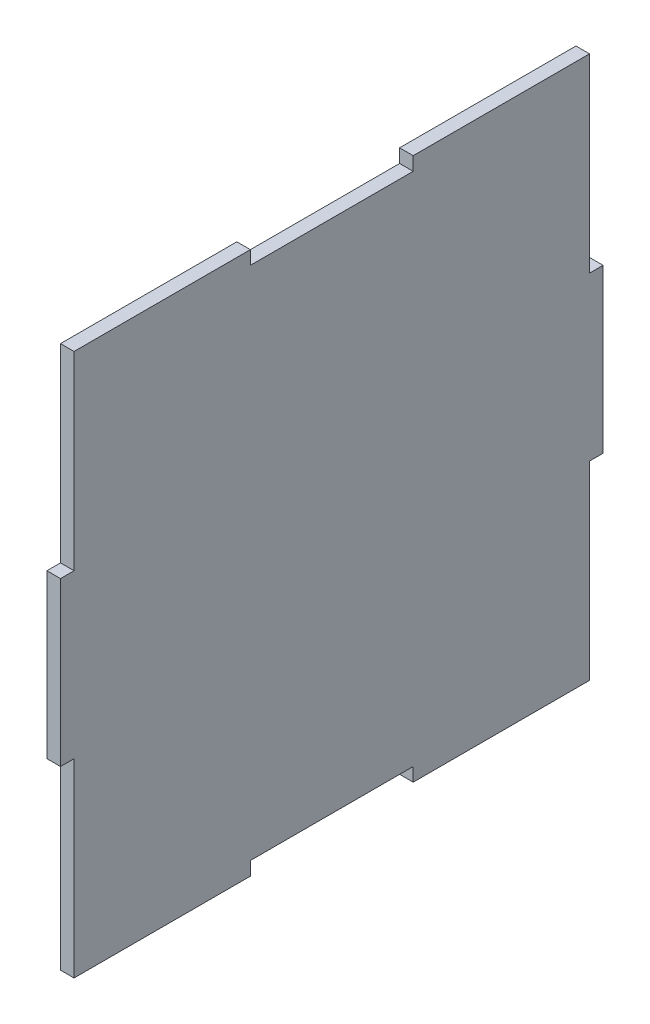
ISO-10303-21;
HEADER;
FILE_DESCRIPTION(('STEP AP214'),'2;1');
FILE_NAME('part.step','',(''),(''),'','','');
FILE_SCHEMA(('AUTOMOTIVE_DESIGN { 1 0 10303 214 1 1 1 1 }'));
ENDSEC;
DATA;
#1=APPLICATION_CONTEXT('core data for automotive mechanical design processes');
#2=APPLICATION_PROTOCOL_DEFINITION('international standard','automotive_design',2000,#1);
#3=PRODUCT_CONTEXT('',#1,'mechanical');
#4=PRODUCT('Part','Part','',(#3));
#5=PRODUCT_RELATED_PRODUCT_CATEGORY('part','',(#4));
#6=PRODUCT_DEFINITION_FORMATION('','',#4);
#7=PRODUCT_DEFINITION_CONTEXT('part definition',#1,'design');
#8=PRODUCT_DEFINITION('design','',#6,#7);
#9=PRODUCT_DEFINITION_SHAPE('','',#8);
#10=(LENGTH_UNIT() NAMED_UNIT(*) SI_UNIT(.MILLI.,.METRE.));
#11=(NAMED_UNIT(*) PLANE_ANGLE_UNIT() SI_UNIT($,.RADIAN.));
#12=(NAMED_UNIT(*) SI_UNIT($,.STERADIAN.) SOLID_ANGLE_UNIT());
#13=UNCERTAINTY_MEASURE_WITH_UNIT(LENGTH_MEASURE(1.E-05),#10,'distance_accuracy_value','');
#14=(GEOMETRIC_REPRESENTATION_CONTEXT(3) GLOBAL_UNCERTAINTY_ASSIGNED_CONTEXT((#13)) GLOBAL_UNIT_ASSIGNED_CONTEXT((#10,
#11,#12)) REPRESENTATION_CONTEXT('',''));
#15=CARTESIAN_POINT('',(0.,0.,0.));
#16=DIRECTION('',(0.,0.,1.));
#17=DIRECTION('',(1.,0.,0.));
#18=AXIS2_PLACEMENT_3D('',#15,#16,#17);
#19=CARTESIAN_POINT('',(3.175,-19.05,63.5));
#20=DIRECTION('',(0.,1.,0.));
#21=DIRECTION('',(0.,0.,1.));
#22=AXIS2_PLACEMENT_3D('',#19,#20,#21);
#23=PLANE('',#22);
#24=DIRECTION('',(0.,0.,-1.));
#25=VECTOR('',#24,1.);
#26=CARTESIAN_POINT('',(0.,-19.05,63.5));
#27=LINE('',#26,#25);
#28=CARTESIAN_POINT('',(0.,-19.05,63.5));
#29=VERTEX_POINT('',#28);
#30=CARTESIAN_POINT('',(0.,-19.05,60.325));
#31=VERTEX_POINT('',#30);
#32=EDGE_CURVE('E211',#29,#31,#27,.T.);
#33=ORIENTED_EDGE('',*,*,#32,.T.);
#34=DIRECTION('',(-1.,0.,0.));
#35=VECTOR('',#34,1.);
#36=CARTESIAN_POINT('',(3.175,-19.05,60.325));
#37=LINE('',#36,#35);
#38=CARTESIAN_POINT('',(3.175,-19.05,60.325));
#39=VERTEX_POINT('',#38);
#40=EDGE_CURVE('E11',#39,#31,#37,.T.);
#41=ORIENTED_EDGE('',*,*,#40,.F.);
#42=DIRECTION('',(0.,0.,-1.));
#43=VECTOR('',#42,1.);
#44=CARTESIAN_POINT('',(3.175,-19.05,63.5));
#45=LINE('',#44,#43);
#46=CARTESIAN_POINT('',(3.175,-19.05,63.5));
#47=VERTEX_POINT('',#46);
#48=EDGE_CURVE('E129',#47,#39,#45,.T.);
#49=ORIENTED_EDGE('',*,*,#48,.F.);
#50=DIRECTION('',(-1.,0.,0.));
#51=VECTOR('',#50,1.);
#52=CARTESIAN_POINT('',(3.175,-19.05,63.5));
#53=LINE('',#52,#51);
#54=EDGE_CURVE('E56',#47,#29,#53,.T.);
#55=ORIENTED_EDGE('',*,*,#54,.T.);
#56=EDGE_LOOP('',(#33,#41,#49,#55));
#57=FACE_BOUND('',#56,.T.);
#58=ADVANCED_FACE('F39',(#57),#23,.F.);
#59=CARTESIAN_POINT('',(3.175,-63.5,60.325));
#60=DIRECTION('',(0.,0.,1.));
#61=DIRECTION('',(1.,0.,0.));
#62=AXIS2_PLACEMENT_3D('',#59,#60,#61);
#63=PLANE('',#62);
#64=DIRECTION('',(0.,1.,0.));
#65=VECTOR('',#64,1.);
#66=CARTESIAN_POINT('',(0.,-63.5,60.325));
#67=LINE('',#66,#65);
#68=CARTESIAN_POINT('',(0.,-63.5,60.325));
#69=VERTEX_POINT('',#68);
#70=EDGE_CURVE('E214',#69,#31,#67,.T.);
#71=ORIENTED_EDGE('',*,*,#70,.F.);
#72=DIRECTION('',(-1.,0.,0.));
#73=VECTOR('',#72,1.);
#74=CARTESIAN_POINT('',(3.175,-63.5,60.325));
#75=LINE('',#74,#73);
#76=CARTESIAN_POINT('',(3.175,-63.5,60.325));
#77=VERTEX_POINT('',#76);
#78=EDGE_CURVE('E48',#77,#69,#75,.T.);
#79=ORIENTED_EDGE('',*,*,#78,.F.);
#80=DIRECTION('',(0.,1.,0.));
#81=VECTOR('',#80,1.);
#82=CARTESIAN_POINT('',(3.175,-63.5,60.325));
#83=LINE('',#82,#81);
#84=EDGE_CURVE('E349',#77,#39,#83,.T.);
#85=ORIENTED_EDGE('',*,*,#84,.T.);
#86=ORIENTED_EDGE('',*,*,#40,.T.);
#87=EDGE_LOOP('',(#71,#79,#85,#86));
#88=FACE_BOUND('',#87,.T.);
#89=ADVANCED_FACE('F348',(#88),#63,.T.);
#90=CARTESIAN_POINT('',(3.175,-63.5,60.325));
#91=DIRECTION('',(0.,1.,0.));
#92=DIRECTION('',(0.,0.,1.));
#93=AXIS2_PLACEMENT_3D('',#90,#91,#92);
#94=PLANE('',#93);
#95=DIRECTION('',(0.,0.,-1.));
#96=VECTOR('',#95,1.);
#97=CARTESIAN_POINT('',(0.,-63.5,60.325));
#98=LINE('',#97,#96);
#99=CARTESIAN_POINT('',(0.,-63.4999999999999,19.05));
#100=VERTEX_POINT('',#99);
#101=EDGE_CURVE('E218',#69,#100,#98,.T.);
#102=ORIENTED_EDGE('',*,*,#101,.T.);
#103=DIRECTION('',(-1.,0.,0.));
#104=VECTOR('',#103,1.);
#105=CARTESIAN_POINT('',(3.175,-63.4999999999999,19.05));
#106=LINE('',#105,#104);
#107=CARTESIAN_POINT('',(3.175,-63.4999999999999,19.05));
#108=VERTEX_POINT('',#107);
#109=EDGE_CURVE('E331',#108,#100,#106,.T.);
#110=ORIENTED_EDGE('',*,*,#109,.F.);
#111=DIRECTION('',(0.,0.,-1.));
#112=VECTOR('',#111,1.);
#113=CARTESIAN_POINT('',(3.175,-63.5,60.325));
#114=LINE('',#113,#112);
#115=EDGE_CURVE('E340',#77,#108,#114,.T.);
#116=ORIENTED_EDGE('',*,*,#115,.F.);
#117=ORIENTED_EDGE('',*,*,#78,.T.);
#118=EDGE_LOOP('',(#102,#110,#116,#117));
#119=FACE_BOUND('',#118,.T.);
#120=ADVANCED_FACE('F338',(#119),#94,.F.);
#121=CARTESIAN_POINT('',(3.175,-63.4999999999999,19.05));
#122=DIRECTION('',(0.,0.,1.));
#123=DIRECTION('',(1.,0.,0.));
#124=AXIS2_PLACEMENT_3D('',#121,#122,#123);
#125=PLANE('',#124);
#126=DIRECTION('',(0.,1.,0.));
#127=VECTOR('',#126,1.);
#128=CARTESIAN_POINT('',(0.,-63.4999999999999,19.05));
#129=LINE('',#128,#127);
#130=CARTESIAN_POINT('',(0.,-60.3249999999999,19.05));
#131=VERTEX_POINT('',#130);
#132=EDGE_CURVE('E221',#100,#131,#129,.T.);
#133=ORIENTED_EDGE('',*,*,#132,.T.);
#134=DIRECTION('',(-1.,0.,0.));
#135=VECTOR('',#134,1.);
#136=CARTESIAN_POINT('',(3.175,-60.3249999999999,19.05));
#137=LINE('',#136,#135);
#138=CARTESIAN_POINT('',(3.175,-60.3249999999999,19.05));
#139=VERTEX_POINT('',#138);
#140=EDGE_CURVE('E327',#139,#131,#137,.T.);
#141=ORIENTED_EDGE('',*,*,#140,.F.);
#142=DIRECTION('',(0.,1.,0.));
#143=VECTOR('',#142,1.);
#144=CARTESIAN_POINT('',(3.175,-63.4999999999999,19.05));
#145=LINE('',#144,#143);
#146=EDGE_CURVE('E600',#108,#139,#145,.T.);
#147=ORIENTED_EDGE('',*,*,#146,.F.);
#148=ORIENTED_EDGE('',*,*,#109,.T.);
#149=EDGE_LOOP('',(#133,#141,#147,#148));
#150=FACE_BOUND('',#149,.T.);
#151=ADVANCED_FACE('F367',(#150),#125,.F.);
#152=CARTESIAN_POINT('',(3.175,-60.3249999999999,19.05));
#153=DIRECTION('',(0.,1.,0.));
#154=DIRECTION('',(0.,0.,1.));
#155=AXIS2_PLACEMENT_3D('',#152,#153,#154);
#156=PLANE('',#155);
#157=DIRECTION('',(0.,0.,-1.));
#158=VECTOR('',#157,1.);
#159=CARTESIAN_POINT('',(0.,-60.3249999999999,19.05));
#160=LINE('',#159,#158);
#161=CARTESIAN_POINT('',(0.,-60.3249999999999,-19.05));
#162=VERTEX_POINT('',#161);
#163=EDGE_CURVE('E224',#131,#162,#160,.T.);
#164=ORIENTED_EDGE('',*,*,#163,.T.);
#165=DIRECTION('',(-1.,0.,0.));
#166=VECTOR('',#165,1.);
#167=CARTESIAN_POINT('',(3.175,-60.3249999999999,-19.05));
#168=LINE('',#167,#166);
#169=CARTESIAN_POINT('',(3.175,-60.3249999999999,-19.05));
#170=VERTEX_POINT('',#169);
#171=EDGE_CURVE('E324',#170,#162,#168,.T.);
#172=ORIENTED_EDGE('',*,*,#171,.F.);
#173=DIRECTION('',(0.,0.,-1.));
#174=VECTOR('',#173,1.);
#175=CARTESIAN_POINT('',(3.175,-60.3249999999999,19.05));
#176=LINE('',#175,#174);
#177=EDGE_CURVE('E598',#139,#170,#176,.T.);
#178=ORIENTED_EDGE('',*,*,#177,.F.);
#179=ORIENTED_EDGE('',*,*,#140,.T.);
#180=EDGE_LOOP('',(#164,#172,#178,#179));
#181=FACE_BOUND('',#180,.T.);
#182=ADVANCED_FACE('F372',(#181),#156,.F.);
#183=CARTESIAN_POINT('',(3.175,-63.4999999999999,-19.05));
#184=DIRECTION('',(0.,0.,1.));
#185=DIRECTION('',(1.,0.,0.));
#186=AXIS2_PLACEMENT_3D('',#183,#184,#185);
#187=PLANE('',#186);
#188=DIRECTION('',(0.,1.,0.));
#189=VECTOR('',#188,1.);
#190=CARTESIAN_POINT('',(0.,-63.4999999999999,-19.05));
#191=LINE('',#190,#189);
#192=CARTESIAN_POINT('',(0.,-63.4999999999999,-19.05));
#193=VERTEX_POINT('',#192);
#194=EDGE_CURVE('E228',#193,#162,#191,.T.);
#195=ORIENTED_EDGE('',*,*,#194,.F.);
#196=DIRECTION('',(-1.,0.,0.));
#197=VECTOR('',#196,1.);
#198=CARTESIAN_POINT('',(3.175,-63.4999999999999,-19.05));
#199=LINE('',#198,#197);
#200=CARTESIAN_POINT('',(3.175,-63.4999999999999,-19.05));
#201=VERTEX_POINT('',#200);
#202=EDGE_CURVE('E321',#201,#193,#199,.T.);
#203=ORIENTED_EDGE('',*,*,#202,.F.);
#204=DIRECTION('',(0.,1.,0.));
#205=VECTOR('',#204,1.);
#206=CARTESIAN_POINT('',(3.175,-63.4999999999999,-19.05));
#207=LINE('',#206,#205);
#208=EDGE_CURVE('E594',#201,#170,#207,.T.);
#209=ORIENTED_EDGE('',*,*,#208,.T.);
#210=ORIENTED_EDGE('',*,*,#171,.T.);
#211=EDGE_LOOP('',(#195,#203,#209,#210));
#212=FACE_BOUND('',#211,.T.);
#213=ADVANCED_FACE('F376',(#212),#187,.T.);
#214=CARTESIAN_POINT('',(3.175,-63.4999999999999,-19.05));
#215=DIRECTION('',(0.,1.,0.));
#216=DIRECTION('',(0.,0.,1.));
#217=AXIS2_PLACEMENT_3D('',#214,#215,#216);
#218=PLANE('',#217);
#219=DIRECTION('',(0.,0.,-1.));
#220=VECTOR('',#219,1.);
#221=CARTESIAN_POINT('',(0.,-63.4999999999999,-19.05));
#222=LINE('',#221,#220);
#223=CARTESIAN_POINT('',(0.,-63.5,-60.3249999999998));
#224=VERTEX_POINT('',#223);
#225=EDGE_CURVE('E232',#193,#224,#222,.T.);
#226=ORIENTED_EDGE('',*,*,#225,.T.);
#227=DIRECTION('',(-1.,0.,0.));
#228=VECTOR('',#227,1.);
#229=CARTESIAN_POINT('',(3.175,-63.5,-60.3249999999998));
#230=LINE('',#229,#228);
#231=CARTESIAN_POINT('',(3.175,-63.5,-60.3249999999998));
#232=VERTEX_POINT('',#231);
#233=EDGE_CURVE('E317',#232,#224,#230,.T.);
#234=ORIENTED_EDGE('',*,*,#233,.F.);
#235=DIRECTION('',(0.,0.,-1.));
#236=VECTOR('',#235,1.);
#237=CARTESIAN_POINT('',(3.175,-63.4999999999999,-19.05));
#238=LINE('',#237,#236);
#239=EDGE_CURVE('E591',#201,#232,#238,.T.);
#240=ORIENTED_EDGE('',*,*,#239,.F.);
#241=ORIENTED_EDGE('',*,*,#202,.T.);
#242=EDGE_LOOP('',(#226,#234,#240,#241));
#243=FACE_BOUND('',#242,.T.);
#244=ADVANCED_FACE('F380',(#243),#218,.F.);
#245=CARTESIAN_POINT('',(3.175,-63.5,-60.3249999999998));
#246=DIRECTION('',(0.,0.,1.));
#247=DIRECTION('',(1.,0.,0.));
#248=AXIS2_PLACEMENT_3D('',#245,#246,#247);
#249=PLANE('',#248);
#250=DIRECTION('',(0.,1.,0.));
#251=VECTOR('',#250,1.);
#252=CARTESIAN_POINT('',(0.,-63.5,-60.3249999999998));
#253=LINE('',#252,#251);
#254=CARTESIAN_POINT('',(0.,-19.05,-60.3249999999998));
#255=VERTEX_POINT('',#254);
#256=EDGE_CURVE('E235',#224,#255,#253,.T.);
#257=ORIENTED_EDGE('',*,*,#256,.T.);
#258=DIRECTION('',(-1.,0.,0.));
#259=VECTOR('',#258,1.);
#260=CARTESIAN_POINT('',(3.175,-19.05,-60.3249999999998));
#261=LINE('',#260,#259);
#262=CARTESIAN_POINT('',(3.175,-19.05,-60.3249999999998));
#263=VERTEX_POINT('',#262);
#264=EDGE_CURVE('E314',#263,#255,#261,.T.);
#265=ORIENTED_EDGE('',*,*,#264,.F.);
#266=DIRECTION('',(0.,1.,0.));
#267=VECTOR('',#266,1.);
#268=CARTESIAN_POINT('',(3.175,-63.5,-60.3249999999998));
#269=LINE('',#268,#267);
#270=EDGE_CURVE('E589',#232,#263,#269,.T.);
#271=ORIENTED_EDGE('',*,*,#270,.F.);
#272=ORIENTED_EDGE('',*,*,#233,.T.);
#273=EDGE_LOOP('',(#257,#265,#271,#272));
#274=FACE_BOUND('',#273,.T.);
#275=ADVANCED_FACE('F384',(#274),#249,.F.);
#276=CARTESIAN_POINT('',(3.175,-19.05,-63.4999999999998));
#277=DIRECTION('',(0.,-1.,0.));
#278=DIRECTION('',(0.,0.,-1.));
#279=AXIS2_PLACEMENT_3D('',#276,#277,#278);
#280=PLANE('',#279);
#281=DIRECTION('',(0.,0.,1.));
#282=VECTOR('',#281,1.);
#283=CARTESIAN_POINT('',(0.,-19.05,-63.4999999999998));
#284=LINE('',#283,#282);
#285=CARTESIAN_POINT('',(0.,-19.05,-63.4999999999998));
#286=VERTEX_POINT('',#285);
#287=EDGE_CURVE('E239',#286,#255,#284,.T.);
#288=ORIENTED_EDGE('',*,*,#287,.F.);
#289=DIRECTION('',(-1.,0.,0.));
#290=VECTOR('',#289,1.);
#291=CARTESIAN_POINT('',(3.175,-19.05,-63.4999999999998));
#292=LINE('',#291,#290);
#293=CARTESIAN_POINT('',(3.175,-19.05,-63.4999999999998));
#294=VERTEX_POINT('',#293);
#295=EDGE_CURVE('E311',#294,#286,#292,.T.);
#296=ORIENTED_EDGE('',*,*,#295,.F.);
#297=DIRECTION('',(0.,0.,1.));
#298=VECTOR('',#297,1.);
#299=CARTESIAN_POINT('',(3.175,-19.05,-63.4999999999998));
#300=LINE('',#299,#298);
#301=EDGE_CURVE('E582',#294,#263,#300,.T.);
#302=ORIENTED_EDGE('',*,*,#301,.T.);
#303=ORIENTED_EDGE('',*,*,#264,.T.);
#304=EDGE_LOOP('',(#288,#296,#302,#303));
#305=FACE_BOUND('',#304,.T.);
#306=ADVANCED_FACE('F388',(#305),#280,.T.);
#307=CARTESIAN_POINT('',(3.175,-19.05,-63.4999999999998));
#308=DIRECTION('',(0.,0.,1.));
#309=DIRECTION('',(1.,0.,0.));
#310=AXIS2_PLACEMENT_3D('',#307,#308,#309);
#311=PLANE('',#310);
#312=DIRECTION('',(0.,1.,0.));
#313=VECTOR('',#312,1.);
#314=CARTESIAN_POINT('',(0.,-19.05,-63.4999999999998));
#315=LINE('',#314,#313);
#316=CARTESIAN_POINT('',(0.,19.05,-63.4999999999998));
#317=VERTEX_POINT('',#316);
#318=EDGE_CURVE('E243',#286,#317,#315,.T.);
#319=ORIENTED_EDGE('',*,*,#318,.T.);
#320=DIRECTION('',(-1.,0.,0.));
#321=VECTOR('',#320,1.);
#322=CARTESIAN_POINT('',(3.175,19.05,-63.4999999999998));
#323=LINE('',#322,#321);
#324=CARTESIAN_POINT('',(3.175,19.05,-63.4999999999998));
#325=VERTEX_POINT('',#324);
#326=EDGE_CURVE('E307',#325,#317,#323,.T.);
#327=ORIENTED_EDGE('',*,*,#326,.F.);
#328=DIRECTION('',(0.,1.,0.));
#329=VECTOR('',#328,1.);
#330=CARTESIAN_POINT('',(3.175,-19.05,-63.4999999999998));
#331=LINE('',#330,#329);
#332=EDGE_CURVE('E579',#294,#325,#331,.T.);
#333=ORIENTED_EDGE('',*,*,#332,.F.);
#334=ORIENTED_EDGE('',*,*,#295,.T.);
#335=EDGE_LOOP('',(#319,#327,#333,#334));
#336=FACE_BOUND('',#335,.T.);
#337=ADVANCED_FACE('F392',(#336),#311,.F.);
#338=CARTESIAN_POINT('',(3.175,19.05,-63.4999999999998));
#339=DIRECTION('',(0.,-1.,0.));
#340=DIRECTION('',(0.,0.,-1.));
#341=AXIS2_PLACEMENT_3D('',#338,#339,#340);
#342=PLANE('',#341);
#343=DIRECTION('',(0.,0.,1.));
#344=VECTOR('',#343,1.);
#345=CARTESIAN_POINT('',(0.,19.05,-63.4999999999998));
#346=LINE('',#345,#344);
#347=CARTESIAN_POINT('',(0.,19.05,-60.3249999999998));
#348=VERTEX_POINT('',#347);
#349=EDGE_CURVE('E246',#317,#348,#346,.T.);
#350=ORIENTED_EDGE('',*,*,#349,.T.);
#351=DIRECTION('',(-1.,0.,0.));
#352=VECTOR('',#351,1.);
#353=CARTESIAN_POINT('',(3.175,19.05,-60.3249999999998));
#354=LINE('',#353,#352);
#355=CARTESIAN_POINT('',(3.175,19.05,-60.3249999999998));
#356=VERTEX_POINT('',#355);
#357=EDGE_CURVE('E304',#356,#348,#354,.T.);
#358=ORIENTED_EDGE('',*,*,#357,.F.);
#359=DIRECTION('',(0.,0.,1.));
#360=VECTOR('',#359,1.);
#361=CARTESIAN_POINT('',(3.175,19.05,-63.4999999999998));
#362=LINE('',#361,#360);
#363=EDGE_CURVE('E577',#325,#356,#362,.T.);
#364=ORIENTED_EDGE('',*,*,#363,.F.);
#365=ORIENTED_EDGE('',*,*,#326,.T.);
#366=EDGE_LOOP('',(#350,#358,#364,#365));
#367=FACE_BOUND('',#366,.T.);
#368=ADVANCED_FACE('F396',(#367),#342,.F.);
#369=CARTESIAN_POINT('',(3.175,63.5,-60.3249999999998));
#370=DIRECTION('',(0.,0.,-1.));
#371=DIRECTION('',(-1.,0.,0.));
#372=AXIS2_PLACEMENT_3D('',#369,#370,#371);
#373=PLANE('',#372);
#374=DIRECTION('',(0.,-1.,0.));
#375=VECTOR('',#374,1.);
#376=CARTESIAN_POINT('',(0.,63.5,-60.3249999999998));
#377=LINE('',#376,#375);
#378=CARTESIAN_POINT('',(0.,63.5,-60.3249999999998));
#379=VERTEX_POINT('',#378);
#380=EDGE_CURVE('E250',#379,#348,#377,.T.);
#381=ORIENTED_EDGE('',*,*,#380,.F.);
#382=DIRECTION('',(-1.,0.,0.));
#383=VECTOR('',#382,1.);
#384=CARTESIAN_POINT('',(3.175,63.5,-60.3249999999998));
#385=LINE('',#384,#383);
#386=CARTESIAN_POINT('',(3.175,63.5,-60.3249999999998));
#387=VERTEX_POINT('',#386);
#388=EDGE_CURVE('E301',#387,#379,#385,.T.);
#389=ORIENTED_EDGE('',*,*,#388,.F.);
#390=DIRECTION('',(0.,-1.,0.));
#391=VECTOR('',#390,1.);
#392=CARTESIAN_POINT('',(3.175,63.5,-60.3249999999998));
#393=LINE('',#392,#391);
#394=EDGE_CURVE('E621',#387,#356,#393,.T.);
#395=ORIENTED_EDGE('',*,*,#394,.T.);
#396=ORIENTED_EDGE('',*,*,#357,.T.);
#397=EDGE_LOOP('',(#381,#389,#395,#396));
#398=FACE_BOUND('',#397,.T.);
#399=ADVANCED_FACE('F400',(#398),#373,.T.);
#400=CARTESIAN_POINT('',(3.175,63.5,-19.05));
#401=DIRECTION('',(0.,1.,0.));
#402=DIRECTION('',(0.,0.,1.));
#403=AXIS2_PLACEMENT_3D('',#400,#401,#402);
#404=PLANE('',#403);
#405=DIRECTION('',(0.,0.,-1.));
#406=VECTOR('',#405,1.);
#407=CARTESIAN_POINT('',(0.,63.5,-19.05));
#408=LINE('',#407,#406);
#409=CARTESIAN_POINT('',(0.,63.5,-19.05));
#410=VERTEX_POINT('',#409);
#411=EDGE_CURVE('E254',#410,#379,#408,.T.);
#412=ORIENTED_EDGE('',*,*,#411,.F.);
#413=DIRECTION('',(-1.,0.,0.));
#414=VECTOR('',#413,1.);
#415=CARTESIAN_POINT('',(3.175,63.5,-19.05));
#416=LINE('',#415,#414);
#417=CARTESIAN_POINT('',(3.175,63.5,-19.05));
#418=VERTEX_POINT('',#417);
#419=EDGE_CURVE('E298',#418,#410,#416,.T.);
#420=ORIENTED_EDGE('',*,*,#419,.F.);
#421=DIRECTION('',(0.,0.,-1.));
#422=VECTOR('',#421,1.);
#423=CARTESIAN_POINT('',(3.175,63.5,-19.05));
#424=LINE('',#423,#422);
#425=EDGE_CURVE('E568',#418,#387,#424,.T.);
#426=ORIENTED_EDGE('',*,*,#425,.T.);
#427=ORIENTED_EDGE('',*,*,#388,.T.);
#428=EDGE_LOOP('',(#412,#420,#426,#427));
#429=FACE_BOUND('',#428,.T.);
#430=ADVANCED_FACE('F404',(#429),#404,.T.);
#431=CARTESIAN_POINT('',(3.175,63.5,-19.05));
#432=DIRECTION('',(0.,0.,-1.));
#433=DIRECTION('',(-1.,0.,0.));
#434=AXIS2_PLACEMENT_3D('',#431,#432,#433);
#435=PLANE('',#434);
#436=DIRECTION('',(0.,-1.,0.));
#437=VECTOR('',#436,1.);
#438=CARTESIAN_POINT('',(0.,63.5,-19.05));
#439=LINE('',#438,#437);
#440=CARTESIAN_POINT('',(0.,60.325,-19.05));
#441=VERTEX_POINT('',#440);
#442=EDGE_CURVE('E258',#410,#441,#439,.T.);
#443=ORIENTED_EDGE('',*,*,#442,.T.);
#444=DIRECTION('',(-1.,0.,0.));
#445=VECTOR('',#444,1.);
#446=CARTESIAN_POINT('',(3.175,60.325,-19.05));
#447=LINE('',#446,#445);
#448=CARTESIAN_POINT('',(3.175,60.325,-19.05));
#449=VERTEX_POINT('',#448);
#450=EDGE_CURVE('E295',#449,#441,#447,.T.);
#451=ORIENTED_EDGE('',*,*,#450,.F.);
#452=DIRECTION('',(0.,-1.,0.));
#453=VECTOR('',#452,1.);
#454=CARTESIAN_POINT('',(3.175,63.5,-19.05));
#455=LINE('',#454,#453);
#456=EDGE_CURVE('E626',#418,#449,#455,.T.);
#457=ORIENTED_EDGE('',*,*,#456,.F.);
#458=ORIENTED_EDGE('',*,*,#419,.T.);
#459=EDGE_LOOP('',(#443,#451,#457,#458));
#460=FACE_BOUND('',#459,.T.);
#461=ADVANCED_FACE('F408',(#460),#435,.F.);
#462=CARTESIAN_POINT('',(3.175,60.325,19.05));
#463=DIRECTION('',(0.,1.,0.));
#464=DIRECTION('',(0.,0.,1.));
#465=AXIS2_PLACEMENT_3D('',#462,#463,#464);
#466=PLANE('',#465);
#467=DIRECTION('',(0.,0.,-1.));
#468=VECTOR('',#467,1.);
#469=CARTESIAN_POINT('',(0.,60.325,19.05));
#470=LINE('',#469,#468);
#471=CARTESIAN_POINT('',(0.,60.325,19.05));
#472=VERTEX_POINT('',#471);
#473=EDGE_CURVE('E262',#472,#441,#470,.T.);
#474=ORIENTED_EDGE('',*,*,#473,.F.);
#475=DIRECTION('',(-1.,0.,0.));
#476=VECTOR('',#475,1.);
#477=CARTESIAN_POINT('',(3.175,60.325,19.05));
#478=LINE('',#477,#476);
#479=CARTESIAN_POINT('',(3.175,60.325,19.05));
#480=VERTEX_POINT('',#479);
#481=EDGE_CURVE('E292',#480,#472,#478,.T.);
#482=ORIENTED_EDGE('',*,*,#481,.F.);
#483=DIRECTION('',(0.,0.,-1.));
#484=VECTOR('',#483,1.);
#485=CARTESIAN_POINT('',(3.175,60.325,19.05));
#486=LINE('',#485,#484);
#487=EDGE_CURVE('E562',#480,#449,#486,.T.);
#488=ORIENTED_EDGE('',*,*,#487,.T.);
#489=ORIENTED_EDGE('',*,*,#450,.T.);
#490=EDGE_LOOP('',(#474,#482,#488,#489));
#491=FACE_BOUND('',#490,.T.);
#492=ADVANCED_FACE('F412',(#491),#466,.T.);
#493=CARTESIAN_POINT('',(3.175,63.5,19.05));
#494=DIRECTION('',(0.,0.,-1.));
#495=DIRECTION('',(0.,1.,0.));
#496=AXIS2_PLACEMENT_3D('',#493,#494,#495);
#497=PLANE('',#496);
#498=DIRECTION('',(0.,-1.,0.));
#499=VECTOR('',#498,1.);
#500=CARTESIAN_POINT('',(0.,63.5,19.05));
#501=LINE('',#500,#499);
#502=CARTESIAN_POINT('',(0.,63.5,19.05));
#503=VERTEX_POINT('',#502);
#504=EDGE_CURVE('E266',#503,#472,#501,.T.);
#505=ORIENTED_EDGE('',*,*,#504,.F.);
#506=DIRECTION('',(-1.,0.,0.));
#507=VECTOR('',#506,1.);
#508=CARTESIAN_POINT('',(3.175,63.5,19.05));
#509=LINE('',#508,#507);
#510=CARTESIAN_POINT('',(3.175,63.5,19.05));
#511=VERTEX_POINT('',#510);
#512=EDGE_CURVE('E289',#511,#503,#509,.T.);
#513=ORIENTED_EDGE('',*,*,#512,.F.);
#514=DIRECTION('',(0.,-1.,0.));
#515=VECTOR('',#514,1.);
#516=CARTESIAN_POINT('',(3.175,63.5,19.05));
#517=LINE('',#516,#515);
#518=EDGE_CURVE('E558',#511,#480,#517,.T.);
#519=ORIENTED_EDGE('',*,*,#518,.T.);
#520=ORIENTED_EDGE('',*,*,#481,.T.);
#521=EDGE_LOOP('',(#505,#513,#519,#520));
#522=FACE_BOUND('',#521,.T.);
#523=ADVANCED_FACE('F416',(#522),#497,.T.);
#524=CARTESIAN_POINT('',(3.175,63.5,60.325));
#525=DIRECTION('',(0.,1.,0.));
#526=DIRECTION('',(0.,0.,1.));
#527=AXIS2_PLACEMENT_3D('',#524,#525,#526);
#528=PLANE('',#527);
#529=DIRECTION('',(0.,0.,-1.));
#530=VECTOR('',#529,1.);
#531=CARTESIAN_POINT('',(0.,63.5,60.325));
#532=LINE('',#531,#530);
#533=CARTESIAN_POINT('',(0.,63.5,60.325));
#534=VERTEX_POINT('',#533);
#535=EDGE_CURVE('E270',#534,#503,#532,.T.);
#536=ORIENTED_EDGE('',*,*,#535,.F.);
#537=DIRECTION('',(-1.,0.,0.));
#538=VECTOR('',#537,1.);
#539=CARTESIAN_POINT('',(3.175,63.5,60.325));
#540=LINE('',#539,#538);
#541=CARTESIAN_POINT('',(3.175,63.5,60.325));
#542=VERTEX_POINT('',#541);
#543=EDGE_CURVE('E201',#542,#534,#540,.T.);
#544=ORIENTED_EDGE('',*,*,#543,.F.);
#545=DIRECTION('',(0.,0.,-1.));
#546=VECTOR('',#545,1.);
#547=CARTESIAN_POINT('',(3.175,63.5,60.325));
#548=LINE('',#547,#546);
#549=EDGE_CURVE('E189',#542,#511,#548,.T.);
#550=ORIENTED_EDGE('',*,*,#549,.T.);
#551=ORIENTED_EDGE('',*,*,#512,.T.);
#552=EDGE_LOOP('',(#536,#544,#550,#551));
#553=FACE_BOUND('',#552,.T.);
#554=ADVANCED_FACE('F420',(#553),#528,.T.);
#555=CARTESIAN_POINT('',(3.175,63.5,60.325));
#556=DIRECTION('',(0.,0.,-1.));
#557=DIRECTION('',(0.,1.,0.));
#558=AXIS2_PLACEMENT_3D('',#555,#556,#557);
#559=PLANE('',#558);
#560=DIRECTION('',(0.,-1.,0.));
#561=VECTOR('',#560,1.);
#562=CARTESIAN_POINT('',(0.,63.5,60.325));
#563=LINE('',#562,#561);
#564=CARTESIAN_POINT('',(0.,19.05,60.325));
#565=VERTEX_POINT('',#564);
#566=EDGE_CURVE('E197',#534,#565,#563,.T.);
#567=ORIENTED_EDGE('',*,*,#566,.T.);
#568=DIRECTION('',(-1.,0.,0.));
#569=VECTOR('',#568,1.);
#570=CARTESIAN_POINT('',(3.175,19.05,60.325));
#571=LINE('',#570,#569);
#572=CARTESIAN_POINT('',(3.175,19.05,60.325));
#573=VERTEX_POINT('',#572);
#574=EDGE_CURVE('E194',#573,#565,#571,.T.);
#575=ORIENTED_EDGE('',*,*,#574,.F.);
#576=DIRECTION('',(0.,-1.,0.));
#577=VECTOR('',#576,1.);
#578=CARTESIAN_POINT('',(3.175,63.5,60.325));
#579=LINE('',#578,#577);
#580=EDGE_CURVE('E182',#542,#573,#579,.T.);
#581=ORIENTED_EDGE('',*,*,#580,.F.);
#582=ORIENTED_EDGE('',*,*,#543,.T.);
#583=EDGE_LOOP('',(#567,#575,#581,#582));
#584=FACE_BOUND('',#583,.T.);
#585=ADVANCED_FACE('F195',(#584),#559,.F.);
#586=CARTESIAN_POINT('',(3.175,19.05,63.5));
#587=DIRECTION('',(0.,1.,0.));
#588=DIRECTION('',(0.,0.,1.));
#589=AXIS2_PLACEMENT_3D('',#586,#587,#588);
#590=PLANE('',#589);
#591=DIRECTION('',(0.,0.,-1.));
#592=VECTOR('',#591,1.);
#593=CARTESIAN_POINT('',(0.,19.05,63.5));
#594=LINE('',#593,#592);
#595=CARTESIAN_POINT('',(0.,19.05,63.5));
#596=VERTEX_POINT('',#595);
#597=EDGE_CURVE('E276',#596,#565,#594,.T.);
#598=ORIENTED_EDGE('',*,*,#597,.F.);
#599=DIRECTION('',(-1.,0.,0.));
#600=VECTOR('',#599,1.);
#601=CARTESIAN_POINT('',(3.175,19.05,63.5));
#602=LINE('',#601,#600);
#603=CARTESIAN_POINT('',(3.175,19.05,63.5));
#604=VERTEX_POINT('',#603);
#605=EDGE_CURVE('E117',#604,#596,#602,.T.);
#606=ORIENTED_EDGE('',*,*,#605,.F.);
#607=DIRECTION('',(0.,0.,-1.));
#608=VECTOR('',#607,1.);
#609=CARTESIAN_POINT('',(3.175,19.05,63.5));
#610=LINE('',#609,#608);
#611=EDGE_CURVE('E186',#604,#573,#610,.T.);
#612=ORIENTED_EDGE('',*,*,#611,.T.);
#613=ORIENTED_EDGE('',*,*,#574,.T.);
#614=EDGE_LOOP('',(#598,#606,#612,#613));
#615=FACE_BOUND('',#614,.T.);
#616=ADVANCED_FACE('F203',(#615),#590,.T.);
#617=CARTESIAN_POINT('',(3.175,-19.05,63.5));
#618=DIRECTION('',(0.,0.,1.));
#619=DIRECTION('',(1.,0.,0.));
#620=AXIS2_PLACEMENT_3D('',#617,#618,#619);
#621=PLANE('',#620);
#622=DIRECTION('',(0.,1.,0.));
#623=VECTOR('',#622,1.);
#624=CARTESIAN_POINT('',(0.,-19.05,63.5));
#625=LINE('',#624,#623);
#626=EDGE_CURVE('E279',#29,#596,#625,.T.);
#627=ORIENTED_EDGE('',*,*,#626,.F.);
#628=ORIENTED_EDGE('',*,*,#54,.F.);
#629=DIRECTION('',(0.,1.,0.));
#630=VECTOR('',#629,1.);
#631=CARTESIAN_POINT('',(3.175,-19.05,63.5));
#632=LINE('',#631,#630);
#633=EDGE_CURVE('E205',#47,#604,#632,.T.);
#634=ORIENTED_EDGE('',*,*,#633,.T.);
#635=ORIENTED_EDGE('',*,*,#605,.T.);
#636=EDGE_LOOP('',(#627,#628,#634,#635));
#637=FACE_BOUND('',#636,.T.);
#638=ADVANCED_FACE('F350',(#637),#621,.T.);
#639=CARTESIAN_POINT('',(3.175,0.,0.));
#640=DIRECTION('',(1.,0.,0.));
#641=DIRECTION('',(0.,0.,-1.));
#642=AXIS2_PLACEMENT_3D('',#639,#640,#641);
#643=PLANE('',#642);
#644=ORIENTED_EDGE('',*,*,#48,.T.);
#645=ORIENTED_EDGE('',*,*,#84,.F.);
#646=ORIENTED_EDGE('',*,*,#115,.T.);
#647=ORIENTED_EDGE('',*,*,#146,.T.);
#648=ORIENTED_EDGE('',*,*,#177,.T.);
#649=ORIENTED_EDGE('',*,*,#208,.F.);
#650=ORIENTED_EDGE('',*,*,#239,.T.);
#651=ORIENTED_EDGE('',*,*,#270,.T.);
#652=ORIENTED_EDGE('',*,*,#301,.F.);
#653=ORIENTED_EDGE('',*,*,#332,.T.);
#654=ORIENTED_EDGE('',*,*,#363,.T.);
#655=ORIENTED_EDGE('',*,*,#394,.F.);
#656=ORIENTED_EDGE('',*,*,#425,.F.);
#657=ORIENTED_EDGE('',*,*,#456,.T.);
#658=ORIENTED_EDGE('',*,*,#487,.F.);
#659=ORIENTED_EDGE('',*,*,#518,.F.);
#660=ORIENTED_EDGE('',*,*,#549,.F.);
#661=ORIENTED_EDGE('',*,*,#580,.T.);
#662=ORIENTED_EDGE('',*,*,#611,.F.);
#663=ORIENTED_EDGE('',*,*,#633,.F.);
#664=EDGE_LOOP('',(#644,#645,#646,#647,#648,#649,#650,#651,#652,#653,#654,#655,#656,#657,#658,
#659,#660,#661,#662,#663));
#665=FACE_BOUND('',#664,.T.);
#666=ADVANCED_FACE('F184',(#665),#643,.T.);
#667=CARTESIAN_POINT('',(0.,0.,0.));
#668=DIRECTION('',(1.,0.,0.));
#669=DIRECTION('',(0.,0.,-1.));
#670=AXIS2_PLACEMENT_3D('',#667,#668,#669);
#671=PLANE('',#670);
#672=ORIENTED_EDGE('',*,*,#32,.F.);
#673=ORIENTED_EDGE('',*,*,#626,.T.);
#674=ORIENTED_EDGE('',*,*,#597,.T.);
#675=ORIENTED_EDGE('',*,*,#566,.F.);
#676=ORIENTED_EDGE('',*,*,#535,.T.);
#677=ORIENTED_EDGE('',*,*,#504,.T.);
#678=ORIENTED_EDGE('',*,*,#473,.T.);
#679=ORIENTED_EDGE('',*,*,#442,.F.);
#680=ORIENTED_EDGE('',*,*,#411,.T.);
#681=ORIENTED_EDGE('',*,*,#380,.T.);
#682=ORIENTED_EDGE('',*,*,#349,.F.);
#683=ORIENTED_EDGE('',*,*,#318,.F.);
#684=ORIENTED_EDGE('',*,*,#287,.T.);
#685=ORIENTED_EDGE('',*,*,#256,.F.);
#686=ORIENTED_EDGE('',*,*,#225,.F.);
#687=ORIENTED_EDGE('',*,*,#194,.T.);
#688=ORIENTED_EDGE('',*,*,#163,.F.);
#689=ORIENTED_EDGE('',*,*,#132,.F.);
#690=ORIENTED_EDGE('',*,*,#101,.F.);
#691=ORIENTED_EDGE('',*,*,#70,.T.);
#692=EDGE_LOOP('',(#672,#673,#674,#675,#676,#677,#678,#679,#680,#681,#682,#683,#684,#685,#686,
#687,#688,#689,#690,#691));
#693=FACE_BOUND('',#692,.T.);
#694=ADVANCED_FACE('F346',(#693),#671,.F.);
#695=CLOSED_SHELL('',(#58,#89,#120,#151,#182,#213,#244,#275,#306,#337,#368,#399,#430,#461,#492,
#523,#554,#585,#616,#638,#666,#694));
#696=MANIFOLD_SOLID_BREP('B2',#695);
#697=ADVANCED_BREP_SHAPE_REPRESENTATION('',(#18,#696),#14);
#698=SHAPE_DEFINITION_REPRESENTATION(#9,#697);
ENDSEC;
END-ISO-10303-21;
